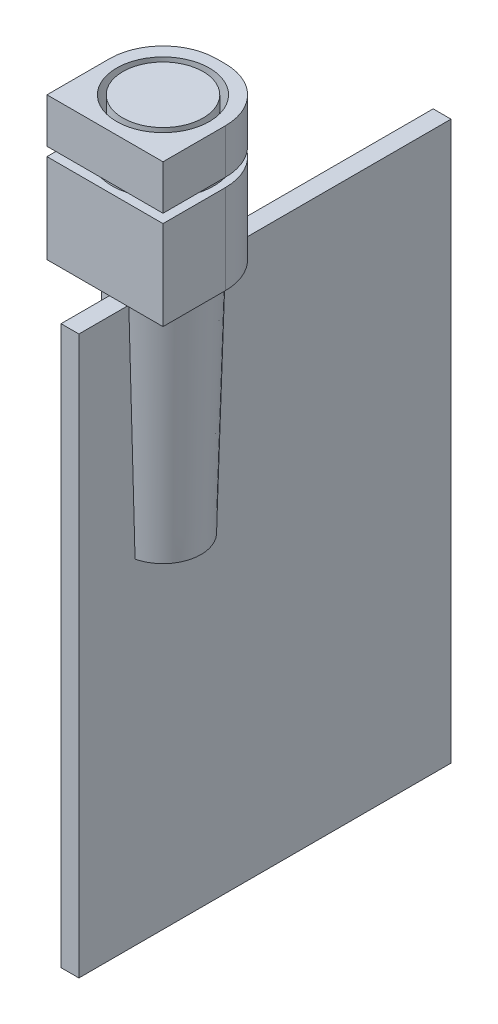
ISO-10303-21;
HEADER;
FILE_DESCRIPTION(('STEP AP214'),'2;1');
FILE_NAME('part.step','',(''),(''),'','','');
FILE_SCHEMA(('AUTOMOTIVE_DESIGN { 1 0 10303 214 1 1 1 1 }'));
ENDSEC;
DATA;
#1=APPLICATION_CONTEXT('core data for automotive mechanical design processes');
#2=APPLICATION_PROTOCOL_DEFINITION('international standard','automotive_design',2000,#1);
#3=PRODUCT_CONTEXT('',#1,'mechanical');
#4=PRODUCT('Part','Part','',(#3));
#5=PRODUCT_RELATED_PRODUCT_CATEGORY('part','',(#4));
#6=PRODUCT_DEFINITION_FORMATION('','',#4);
#7=PRODUCT_DEFINITION_CONTEXT('part definition',#1,'design');
#8=PRODUCT_DEFINITION('design','',#6,#7);
#9=PRODUCT_DEFINITION_SHAPE('','',#8);
#10=(LENGTH_UNIT() NAMED_UNIT(*) SI_UNIT(.MILLI.,.METRE.));
#11=(NAMED_UNIT(*) PLANE_ANGLE_UNIT() SI_UNIT($,.RADIAN.));
#12=(NAMED_UNIT(*) SI_UNIT($,.STERADIAN.) SOLID_ANGLE_UNIT());
#13=UNCERTAINTY_MEASURE_WITH_UNIT(LENGTH_MEASURE(1.E-05),#10,'distance_accuracy_value','');
#14=(GEOMETRIC_REPRESENTATION_CONTEXT(3) GLOBAL_UNCERTAINTY_ASSIGNED_CONTEXT((#13)) GLOBAL_UNIT_ASSIGNED_CONTEXT((#10,
#11,#12)) REPRESENTATION_CONTEXT('',''));
#15=CARTESIAN_POINT('',(0.,0.,0.));
#16=DIRECTION('',(0.,0.,1.));
#17=DIRECTION('',(1.,0.,0.));
#18=AXIS2_PLACEMENT_3D('',#15,#16,#17);
#19=CARTESIAN_POINT('',(-650.,-1600.,650.));
#20=DIRECTION('',(-1.,0.,0.));
#21=DIRECTION('',(0.,0.,1.));
#22=AXIS2_PLACEMENT_3D('',#19,#20,#21);
#23=PLANE('',#22);
#24=DIRECTION('',(0.,0.,1.));
#25=VECTOR('',#24,1.);
#26=CARTESIAN_POINT('',(-650.,-600.,650.));
#27=LINE('',#26,#25);
#28=CARTESIAN_POINT('',(-650.,-600.,-49.9999999999998));
#29=VERTEX_POINT('',#28);
#30=CARTESIAN_POINT('',(-650.,-600.,650.));
#31=VERTEX_POINT('',#30);
#32=EDGE_CURVE('E133',#29,#31,#27,.T.);
#33=ORIENTED_EDGE('',*,*,#32,.F.);
#34=DIRECTION('',(0.,1.,0.));
#35=VECTOR('',#34,1.);
#36=CARTESIAN_POINT('',(-650.,-1600.,-49.9999999999998));
#37=LINE('',#36,#35);
#38=CARTESIAN_POINT('',(-650.,-1600.,-49.9999999999998));
#39=VERTEX_POINT('',#38);
#40=EDGE_CURVE('E77',#29,#39,#37,.F.);
#41=ORIENTED_EDGE('',*,*,#40,.T.);
#42=DIRECTION('',(0.,0.,1.));
#43=VECTOR('',#42,1.);
#44=CARTESIAN_POINT('',(-650.,-1600.,650.));
#45=LINE('',#44,#43);
#46=CARTESIAN_POINT('',(-650.,-1600.,650.));
#47=VERTEX_POINT('',#46);
#48=EDGE_CURVE('E108',#39,#47,#45,.T.);
#49=ORIENTED_EDGE('',*,*,#48,.T.);
#50=DIRECTION('',(0.,1.,0.));
#51=VECTOR('',#50,1.);
#52=CARTESIAN_POINT('',(-650.,-1600.,650.));
#53=LINE('',#52,#51);
#54=EDGE_CURVE('E110',#47,#31,#53,.T.);
#55=ORIENTED_EDGE('',*,*,#54,.T.);
#56=EDGE_LOOP('',(#33,#41,#49,#55));
#57=FACE_BOUND('',#56,.T.);
#58=ADVANCED_FACE('F54',(#57),#23,.T.);
#59=CARTESIAN_POINT('',(650.,-1600.,-650.));
#60=DIRECTION('',(0.,0.,-1.));
#61=DIRECTION('',(-1.,0.,0.));
#62=AXIS2_PLACEMENT_3D('',#59,#60,#61);
#63=PLANE('',#62);
#64=DIRECTION('',(-1.,0.,0.));
#65=VECTOR('',#64,1.);
#66=CARTESIAN_POINT('',(650.,-1600.,-650.));
#67=LINE('',#66,#65);
#68=CARTESIAN_POINT('',(50.0000000000002,-1600.,-650.));
#69=VERTEX_POINT('',#68);
#70=CARTESIAN_POINT('',(-49.9999999999999,-1600.,-650.));
#71=VERTEX_POINT('',#70);
#72=EDGE_CURVE('E123',#69,#71,#67,.T.);
#73=ORIENTED_EDGE('',*,*,#72,.T.);
#74=DIRECTION('',(0.,1.,0.));
#75=VECTOR('',#74,1.);
#76=CARTESIAN_POINT('',(-49.9999999999999,-1600.,-650.));
#77=LINE('',#76,#75);
#78=CARTESIAN_POINT('',(-49.9999999999999,-600.,-650.));
#79=VERTEX_POINT('',#78);
#80=EDGE_CURVE('E145',#71,#79,#77,.T.);
#81=ORIENTED_EDGE('',*,*,#80,.T.);
#82=DIRECTION('',(-1.,0.,0.));
#83=VECTOR('',#82,1.);
#84=CARTESIAN_POINT('',(650.,-600.,-650.));
#85=LINE('',#84,#83);
#86=CARTESIAN_POINT('',(50.0000000000002,-600.,-650.));
#87=VERTEX_POINT('',#86);
#88=EDGE_CURVE('E115',#87,#79,#85,.T.);
#89=ORIENTED_EDGE('',*,*,#88,.F.);
#90=DIRECTION('',(0.,1.,0.));
#91=VECTOR('',#90,1.);
#92=CARTESIAN_POINT('',(50.0000000000002,-1600.,-650.));
#93=LINE('',#92,#91);
#94=EDGE_CURVE('E142',#87,#69,#93,.F.);
#95=ORIENTED_EDGE('',*,*,#94,.T.);
#96=EDGE_LOOP('',(#73,#81,#89,#95));
#97=FACE_BOUND('',#96,.T.);
#98=ADVANCED_FACE('F156',(#97),#63,.T.);
#99=CARTESIAN_POINT('',(650.,-1600.,650.));
#100=DIRECTION('',(1.,0.,0.));
#101=DIRECTION('',(0.,0.,-1.));
#102=AXIS2_PLACEMENT_3D('',#99,#100,#101);
#103=PLANE('',#102);
#104=DIRECTION('',(0.,0.,-1.));
#105=VECTOR('',#104,1.);
#106=CARTESIAN_POINT('',(650.,-1600.,650.));
#107=LINE('',#106,#105);
#108=CARTESIAN_POINT('',(650.,-1600.,650.));
#109=VERTEX_POINT('',#108);
#110=CARTESIAN_POINT('',(650.,-1600.,-49.9999999999999));
#111=VERTEX_POINT('',#110);
#112=EDGE_CURVE('E126',#109,#111,#107,.T.);
#113=ORIENTED_EDGE('',*,*,#112,.T.);
#114=DIRECTION('',(0.,1.,0.));
#115=VECTOR('',#114,1.);
#116=CARTESIAN_POINT('',(650.,-1600.,-49.9999999999999));
#117=LINE('',#116,#115);
#118=CARTESIAN_POINT('',(650.,-600.,-49.9999999999999));
#119=VERTEX_POINT('',#118);
#120=EDGE_CURVE('E13',#111,#119,#117,.T.);
#121=ORIENTED_EDGE('',*,*,#120,.T.);
#122=DIRECTION('',(0.,0.,-1.));
#123=VECTOR('',#122,1.);
#124=CARTESIAN_POINT('',(650.,-600.,650.));
#125=LINE('',#124,#123);
#126=CARTESIAN_POINT('',(650.,-600.,650.));
#127=VERTEX_POINT('',#126);
#128=EDGE_CURVE('E137',#127,#119,#125,.T.);
#129=ORIENTED_EDGE('',*,*,#128,.F.);
#130=DIRECTION('',(0.,1.,0.));
#131=VECTOR('',#130,1.);
#132=CARTESIAN_POINT('',(650.,-1600.,650.));
#133=LINE('',#132,#131);
#134=EDGE_CURVE('E122',#109,#127,#133,.T.);
#135=ORIENTED_EDGE('',*,*,#134,.F.);
#136=EDGE_LOOP('',(#113,#121,#129,#135));
#137=FACE_BOUND('',#136,.T.);
#138=ADVANCED_FACE('F166',(#137),#103,.T.);
#139=CARTESIAN_POINT('',(650.,-1600.,650.));
#140=DIRECTION('',(0.,0.,1.));
#141=DIRECTION('',(1.,0.,0.));
#142=AXIS2_PLACEMENT_3D('',#139,#140,#141);
#143=PLANE('',#142);
#144=DIRECTION('',(1.,0.,0.));
#145=VECTOR('',#144,1.);
#146=CARTESIAN_POINT('',(650.,-600.,650.));
#147=LINE('',#146,#145);
#148=EDGE_CURVE('E121',#31,#127,#147,.T.);
#149=ORIENTED_EDGE('',*,*,#148,.F.);
#150=ORIENTED_EDGE('',*,*,#54,.F.);
#151=DIRECTION('',(1.,0.,0.));
#152=VECTOR('',#151,1.);
#153=CARTESIAN_POINT('',(650.,-1600.,650.));
#154=LINE('',#153,#152);
#155=EDGE_CURVE('E114',#47,#109,#154,.T.);
#156=ORIENTED_EDGE('',*,*,#155,.T.);
#157=ORIENTED_EDGE('',*,*,#134,.T.);
#158=EDGE_LOOP('',(#149,#150,#156,#157));
#159=FACE_BOUND('',#158,.T.);
#160=ADVANCED_FACE('F119',(#159),#143,.T.);
#161=CARTESIAN_POINT('',(0.,-1600.,0.));
#162=DIRECTION('',(0.,1.,0.));
#163=DIRECTION('',(0.,0.,1.));
#164=AXIS2_PLACEMENT_3D('',#161,#162,#163);
#165=PLANE('',#164);
#166=CARTESIAN_POINT('',(0.,-1600.,0.));
#167=DIRECTION('',(0.,1.,0.));
#168=DIRECTION('',(0.,0.,1.));
#169=AXIS2_PLACEMENT_3D('',#166,#167,#168);
#170=CIRCLE('',#169,570.);
#171=CARTESIAN_POINT('',(0.,-1600.,570.));
#172=VERTEX_POINT('',#171);
#173=EDGE_CURVE('E135',#172,#172,#170,.T.);
#174=ORIENTED_EDGE('',*,*,#173,.T.);
#175=EDGE_LOOP('',(#174));
#176=FACE_BOUND('',#175,.T.);
#177=ORIENTED_EDGE('',*,*,#48,.F.);
#178=CARTESIAN_POINT('',(-49.9999999999999,-1600.,-49.9999999999999));
#179=DIRECTION('',(0.,1.,0.));
#180=DIRECTION('',(0.,0.,1.));
#181=AXIS2_PLACEMENT_3D('',#178,#179,#180);
#182=CIRCLE('',#181,600.);
#183=EDGE_CURVE('E62',#39,#71,#182,.F.);
#184=ORIENTED_EDGE('',*,*,#183,.T.);
#185=ORIENTED_EDGE('',*,*,#72,.F.);
#186=CARTESIAN_POINT('',(50.0000000000002,-1600.,-49.9999999999999));
#187=DIRECTION('',(0.,1.,0.));
#188=DIRECTION('',(0.,0.,1.));
#189=AXIS2_PLACEMENT_3D('',#186,#187,#188);
#190=CIRCLE('',#189,600.);
#191=EDGE_CURVE('E69',#69,#111,#190,.F.);
#192=ORIENTED_EDGE('',*,*,#191,.T.);
#193=ORIENTED_EDGE('',*,*,#112,.F.);
#194=ORIENTED_EDGE('',*,*,#155,.F.);
#195=EDGE_LOOP('',(#177,#184,#185,#192,#193,#194));
#196=FACE_BOUND('',#195,.T.);
#197=ADVANCED_FACE('F125',(#176,#196),#165,.F.);
#198=CARTESIAN_POINT('',(0.,-600.,0.));
#199=DIRECTION('',(0.,1.,0.));
#200=DIRECTION('',(0.,0.,1.));
#201=AXIS2_PLACEMENT_3D('',#198,#199,#200);
#202=PLANE('',#201);
#203=CARTESIAN_POINT('',(0.,-600.,0.));
#204=DIRECTION('',(0.,1.,0.));
#205=DIRECTION('',(0.,0.,1.));
#206=AXIS2_PLACEMENT_3D('',#203,#204,#205);
#207=CIRCLE('',#206,570.);
#208=CARTESIAN_POINT('',(0.,-600.,570.));
#209=VERTEX_POINT('',#208);
#210=EDGE_CURVE('E200',#209,#209,#207,.T.);
#211=ORIENTED_EDGE('',*,*,#210,.F.);
#212=EDGE_LOOP('',(#211));
#213=FACE_BOUND('',#212,.T.);
#214=ORIENTED_EDGE('',*,*,#88,.T.);
#215=CARTESIAN_POINT('',(-49.9999999999999,-600.,-49.9999999999999));
#216=DIRECTION('',(0.,1.,0.));
#217=DIRECTION('',(0.,0.,1.));
#218=AXIS2_PLACEMENT_3D('',#215,#216,#217);
#219=CIRCLE('',#218,600.);
#220=EDGE_CURVE('E150',#79,#29,#219,.T.);
#221=ORIENTED_EDGE('',*,*,#220,.T.);
#222=ORIENTED_EDGE('',*,*,#32,.T.);
#223=ORIENTED_EDGE('',*,*,#148,.T.);
#224=ORIENTED_EDGE('',*,*,#128,.T.);
#225=CARTESIAN_POINT('',(50.0000000000002,-600.,-49.9999999999999));
#226=DIRECTION('',(0.,1.,0.));
#227=DIRECTION('',(0.,0.,1.));
#228=AXIS2_PLACEMENT_3D('',#225,#226,#227);
#229=CIRCLE('',#228,600.);
#230=EDGE_CURVE('E148',#119,#87,#229,.T.);
#231=ORIENTED_EDGE('',*,*,#230,.T.);
#232=EDGE_LOOP('',(#214,#221,#222,#223,#224,#231));
#233=FACE_BOUND('',#232,.T.);
#234=ADVANCED_FACE('F161',(#213,#233),#202,.T.);
#235=CARTESIAN_POINT('',(0.,-1600.,0.));
#236=DIRECTION('',(0.,1.,0.));
#237=DIRECTION('',(0.,0.,1.));
#238=AXIS2_PLACEMENT_3D('',#235,#236,#237);
#239=CYLINDRICAL_SURFACE('',#238,570.);
#240=ORIENTED_EDGE('',*,*,#173,.F.);
#241=EDGE_LOOP('',(#240));
#242=FACE_BOUND('',#241,.T.);
#243=ORIENTED_EDGE('',*,*,#210,.T.);
#244=EDGE_LOOP('',(#243));
#245=FACE_BOUND('',#244,.T.);
#246=ADVANCED_FACE('F180',(#242,#245),#239,.F.);
#247=CARTESIAN_POINT('',(-49.9999999999999,-1600.,-49.9999999999999));
#248=DIRECTION('',(0.,1.,0.));
#249=DIRECTION('',(0.,0.,1.));
#250=AXIS2_PLACEMENT_3D('',#247,#248,#249);
#251=CYLINDRICAL_SURFACE('',#250,600.);
#252=ORIENTED_EDGE('',*,*,#183,.F.);
#253=ORIENTED_EDGE('',*,*,#40,.F.);
#254=ORIENTED_EDGE('',*,*,#220,.F.);
#255=ORIENTED_EDGE('',*,*,#80,.F.);
#256=EDGE_LOOP('',(#252,#253,#254,#255));
#257=FACE_BOUND('',#256,.T.);
#258=ADVANCED_FACE('F159',(#257),#251,.T.);
#259=CARTESIAN_POINT('',(50.0000000000002,-1600.,-49.9999999999999));
#260=DIRECTION('',(0.,1.,0.));
#261=DIRECTION('',(0.,0.,1.));
#262=AXIS2_PLACEMENT_3D('',#259,#260,#261);
#263=CYLINDRICAL_SURFACE('',#262,600.);
#264=ORIENTED_EDGE('',*,*,#191,.F.);
#265=ORIENTED_EDGE('',*,*,#94,.F.);
#266=ORIENTED_EDGE('',*,*,#230,.F.);
#267=ORIENTED_EDGE('',*,*,#120,.F.);
#268=EDGE_LOOP('',(#264,#265,#266,#267));
#269=FACE_BOUND('',#268,.T.);
#270=ADVANCED_FACE('F56',(#269),#263,.T.);
#271=CLOSED_SHELL('',(#58,#98,#138,#160,#197,#234,#246,#258,#270));
#272=MANIFOLD_SOLID_BREP('B2',#271);
#273=CARTESIAN_POINT('',(650.,-500.,-650.));
#274=DIRECTION('',(1.,0.,0.));
#275=DIRECTION('',(0.,0.,-1.));
#276=AXIS2_PLACEMENT_3D('',#273,#274,#275);
#277=PLANE('',#276);
#278=DIRECTION('',(0.,0.,-1.));
#279=VECTOR('',#278,1.);
#280=CARTESIAN_POINT('',(650.,-500.,-650.));
#281=LINE('',#280,#279);
#282=CARTESIAN_POINT('',(650.,-500.,650.));
#283=VERTEX_POINT('',#282);
#284=CARTESIAN_POINT('',(650.,-500.,-50.0000000000002));
#285=VERTEX_POINT('',#284);
#286=EDGE_CURVE('E334',#283,#285,#281,.T.);
#287=ORIENTED_EDGE('',*,*,#286,.T.);
#288=DIRECTION('',(0.,1.,0.));
#289=VECTOR('',#288,1.);
#290=CARTESIAN_POINT('',(650.,-500.,-50.0000000000002));
#291=LINE('',#290,#289);
#292=CARTESIAN_POINT('',(650.,0.,-50.0000000000002));
#293=VERTEX_POINT('',#292);
#294=EDGE_CURVE('E52',#285,#293,#291,.T.);
#295=ORIENTED_EDGE('',*,*,#294,.T.);
#296=DIRECTION('',(0.,0.,-1.));
#297=VECTOR('',#296,1.);
#298=CARTESIAN_POINT('',(650.,0.,-650.));
#299=LINE('',#298,#297);
#300=CARTESIAN_POINT('',(650.,0.,650.));
#301=VERTEX_POINT('',#300);
#302=EDGE_CURVE('E338',#301,#293,#299,.T.);
#303=ORIENTED_EDGE('',*,*,#302,.F.);
#304=DIRECTION('',(0.,1.,0.));
#305=VECTOR('',#304,1.);
#306=CARTESIAN_POINT('',(650.,-500.,650.));
#307=LINE('',#306,#305);
#308=EDGE_CURVE('E331',#283,#301,#307,.T.);
#309=ORIENTED_EDGE('',*,*,#308,.F.);
#310=EDGE_LOOP('',(#287,#295,#303,#309));
#311=FACE_BOUND('',#310,.T.);
#312=ADVANCED_FACE('F262',(#311),#277,.T.);
#313=CARTESIAN_POINT('',(-650.,-500.,650.));
#314=DIRECTION('',(0.,0.,1.));
#315=DIRECTION('',(1.,0.,0.));
#316=AXIS2_PLACEMENT_3D('',#313,#314,#315);
#317=PLANE('',#316);
#318=DIRECTION('',(1.,0.,0.));
#319=VECTOR('',#318,1.);
#320=CARTESIAN_POINT('',(-650.,0.,650.));
#321=LINE('',#320,#319);
#322=CARTESIAN_POINT('',(-650.,0.,650.));
#323=VERTEX_POINT('',#322);
#324=EDGE_CURVE('E330',#323,#301,#321,.T.);
#325=ORIENTED_EDGE('',*,*,#324,.F.);
#326=DIRECTION('',(0.,1.,0.));
#327=VECTOR('',#326,1.);
#328=CARTESIAN_POINT('',(-650.,-500.,650.));
#329=LINE('',#328,#327);
#330=CARTESIAN_POINT('',(-650.,-500.,650.));
#331=VERTEX_POINT('',#330);
#332=EDGE_CURVE('E319',#331,#323,#329,.T.);
#333=ORIENTED_EDGE('',*,*,#332,.F.);
#334=DIRECTION('',(1.,0.,0.));
#335=VECTOR('',#334,1.);
#336=CARTESIAN_POINT('',(-650.,-500.,650.));
#337=LINE('',#336,#335);
#338=EDGE_CURVE('E323',#331,#283,#337,.T.);
#339=ORIENTED_EDGE('',*,*,#338,.T.);
#340=ORIENTED_EDGE('',*,*,#308,.T.);
#341=EDGE_LOOP('',(#325,#333,#339,#340));
#342=FACE_BOUND('',#341,.T.);
#343=ADVANCED_FACE('F328',(#342),#317,.T.);
#344=CARTESIAN_POINT('',(-650.,-500.,-650.));
#345=DIRECTION('',(-1.,0.,0.));
#346=DIRECTION('',(0.,0.,1.));
#347=AXIS2_PLACEMENT_3D('',#344,#345,#346);
#348=PLANE('',#347);
#349=DIRECTION('',(0.,0.,1.));
#350=VECTOR('',#349,1.);
#351=CARTESIAN_POINT('',(-650.,0.,-650.));
#352=LINE('',#351,#350);
#353=CARTESIAN_POINT('',(-650.,0.,-49.9999999999999));
#354=VERTEX_POINT('',#353);
#355=EDGE_CURVE('E345',#354,#323,#352,.T.);
#356=ORIENTED_EDGE('',*,*,#355,.F.);
#357=DIRECTION('',(0.,1.,0.));
#358=VECTOR('',#357,1.);
#359=CARTESIAN_POINT('',(-650.,-500.,-49.9999999999999));
#360=LINE('',#359,#358);
#361=CARTESIAN_POINT('',(-650.,-500.,-49.9999999999999));
#362=VERTEX_POINT('',#361);
#363=EDGE_CURVE('E285',#354,#362,#360,.F.);
#364=ORIENTED_EDGE('',*,*,#363,.T.);
#365=DIRECTION('',(0.,0.,1.));
#366=VECTOR('',#365,1.);
#367=CARTESIAN_POINT('',(-650.,-500.,-650.));
#368=LINE('',#367,#366);
#369=EDGE_CURVE('E316',#362,#331,#368,.T.);
#370=ORIENTED_EDGE('',*,*,#369,.T.);
#371=ORIENTED_EDGE('',*,*,#332,.T.);
#372=EDGE_LOOP('',(#356,#364,#370,#371));
#373=FACE_BOUND('',#372,.T.);
#374=ADVANCED_FACE('F318',(#373),#348,.T.);
#375=CARTESIAN_POINT('',(-650.,-500.,-650.));
#376=DIRECTION('',(0.,0.,-1.));
#377=DIRECTION('',(-1.,0.,0.));
#378=AXIS2_PLACEMENT_3D('',#375,#376,#377);
#379=PLANE('',#378);
#380=DIRECTION('',(-1.,0.,0.));
#381=VECTOR('',#380,1.);
#382=CARTESIAN_POINT('',(-650.,-500.,-650.));
#383=LINE('',#382,#381);
#384=CARTESIAN_POINT('',(50.,-500.,-650.));
#385=VERTEX_POINT('',#384);
#386=CARTESIAN_POINT('',(-50.,-500.,-650.));
#387=VERTEX_POINT('',#386);
#388=EDGE_CURVE('E324',#385,#387,#383,.T.);
#389=ORIENTED_EDGE('',*,*,#388,.T.);
#390=DIRECTION('',(0.,1.,0.));
#391=VECTOR('',#390,1.);
#392=CARTESIAN_POINT('',(-50.,-500.,-650.));
#393=LINE('',#392,#391);
#394=CARTESIAN_POINT('',(-50.,0.,-650.));
#395=VERTEX_POINT('',#394);
#396=EDGE_CURVE('E351',#387,#395,#393,.T.);
#397=ORIENTED_EDGE('',*,*,#396,.T.);
#398=DIRECTION('',(-1.,0.,0.));
#399=VECTOR('',#398,1.);
#400=CARTESIAN_POINT('',(-650.,0.,-650.));
#401=LINE('',#400,#399);
#402=CARTESIAN_POINT('',(50.,0.,-650.));
#403=VERTEX_POINT('',#402);
#404=EDGE_CURVE('E341',#403,#395,#401,.T.);
#405=ORIENTED_EDGE('',*,*,#404,.F.);
#406=DIRECTION('',(0.,1.,0.));
#407=VECTOR('',#406,1.);
#408=CARTESIAN_POINT('',(50.,-500.,-650.));
#409=LINE('',#408,#407);
#410=EDGE_CURVE('E348',#403,#385,#409,.F.);
#411=ORIENTED_EDGE('',*,*,#410,.T.);
#412=EDGE_LOOP('',(#389,#397,#405,#411));
#413=FACE_BOUND('',#412,.T.);
#414=ADVANCED_FACE('F363',(#413),#379,.T.);
#415=CARTESIAN_POINT('',(0.,-500.,0.));
#416=DIRECTION('',(0.,1.,0.));
#417=DIRECTION('',(0.,0.,1.));
#418=AXIS2_PLACEMENT_3D('',#415,#416,#417);
#419=PLANE('',#418);
#420=CARTESIAN_POINT('',(0.,-500.,0.));
#421=DIRECTION('',(0.,1.,0.));
#422=DIRECTION('',(0.,0.,1.));
#423=AXIS2_PLACEMENT_3D('',#420,#421,#422);
#424=CIRCLE('',#423,520.);
#425=CARTESIAN_POINT('',(0.,-500.,520.));
#426=VERTEX_POINT('',#425);
#427=EDGE_CURVE('E342',#426,#426,#424,.T.);
#428=ORIENTED_EDGE('',*,*,#427,.T.);
#429=EDGE_LOOP('',(#428));
#430=FACE_BOUND('',#429,.T.);
#431=ORIENTED_EDGE('',*,*,#369,.F.);
#432=CARTESIAN_POINT('',(-50.,-500.,-50.));
#433=DIRECTION('',(0.,1.,0.));
#434=DIRECTION('',(0.,0.,1.));
#435=AXIS2_PLACEMENT_3D('',#432,#433,#434);
#436=CIRCLE('',#435,600.);
#437=EDGE_CURVE('E270',#362,#387,#436,.F.);
#438=ORIENTED_EDGE('',*,*,#437,.T.);
#439=ORIENTED_EDGE('',*,*,#388,.F.);
#440=CARTESIAN_POINT('',(50.,-500.,-50.));
#441=DIRECTION('',(0.,1.,0.));
#442=DIRECTION('',(0.,0.,1.));
#443=AXIS2_PLACEMENT_3D('',#440,#441,#442);
#444=CIRCLE('',#443,600.);
#445=EDGE_CURVE('E277',#385,#285,#444,.F.);
#446=ORIENTED_EDGE('',*,*,#445,.T.);
#447=ORIENTED_EDGE('',*,*,#286,.F.);
#448=ORIENTED_EDGE('',*,*,#338,.F.);
#449=EDGE_LOOP('',(#431,#438,#439,#446,#447,#448));
#450=FACE_BOUND('',#449,.T.);
#451=ADVANCED_FACE('F333',(#430,#450),#419,.F.);
#452=CARTESIAN_POINT('',(0.,0.,0.));
#453=DIRECTION('',(0.,1.,0.));
#454=DIRECTION('',(0.,0.,1.));
#455=AXIS2_PLACEMENT_3D('',#452,#453,#454);
#456=PLANE('',#455);
#457=CARTESIAN_POINT('',(0.,0.,0.));
#458=DIRECTION('',(0.,1.,0.));
#459=DIRECTION('',(0.,0.,1.));
#460=AXIS2_PLACEMENT_3D('',#457,#458,#459);
#461=CIRCLE('',#460,520.);
#462=CARTESIAN_POINT('',(0.,0.,520.));
#463=VERTEX_POINT('',#462);
#464=EDGE_CURVE('E375',#463,#463,#461,.T.);
#465=ORIENTED_EDGE('',*,*,#464,.F.);
#466=EDGE_LOOP('',(#465));
#467=FACE_BOUND('',#466,.T.);
#468=ORIENTED_EDGE('',*,*,#404,.T.);
#469=CARTESIAN_POINT('',(-50.,0.,-50.));
#470=DIRECTION('',(0.,1.,0.));
#471=DIRECTION('',(0.,0.,1.));
#472=AXIS2_PLACEMENT_3D('',#469,#470,#471);
#473=CIRCLE('',#472,600.);
#474=EDGE_CURVE('E356',#395,#354,#473,.T.);
#475=ORIENTED_EDGE('',*,*,#474,.T.);
#476=ORIENTED_EDGE('',*,*,#355,.T.);
#477=ORIENTED_EDGE('',*,*,#324,.T.);
#478=ORIENTED_EDGE('',*,*,#302,.T.);
#479=CARTESIAN_POINT('',(50.,0.,-50.));
#480=DIRECTION('',(0.,1.,0.));
#481=DIRECTION('',(0.,0.,1.));
#482=AXIS2_PLACEMENT_3D('',#479,#480,#481);
#483=CIRCLE('',#482,600.);
#484=EDGE_CURVE('E354',#293,#403,#483,.T.);
#485=ORIENTED_EDGE('',*,*,#484,.T.);
#486=EDGE_LOOP('',(#468,#475,#476,#477,#478,#485));
#487=FACE_BOUND('',#486,.T.);
#488=ADVANCED_FACE('F368',(#467,#487),#456,.T.);
#489=CARTESIAN_POINT('',(0.,-500.,0.));
#490=DIRECTION('',(0.,1.,0.));
#491=DIRECTION('',(0.,0.,1.));
#492=AXIS2_PLACEMENT_3D('',#489,#490,#491);
#493=CYLINDRICAL_SURFACE('',#492,520.);
#494=ORIENTED_EDGE('',*,*,#427,.F.);
#495=EDGE_LOOP('',(#494));
#496=FACE_BOUND('',#495,.T.);
#497=ORIENTED_EDGE('',*,*,#464,.T.);
#498=EDGE_LOOP('',(#497));
#499=FACE_BOUND('',#498,.T.);
#500=ADVANCED_FACE('F382',(#496,#499),#493,.F.);
#501=CARTESIAN_POINT('',(-50.,-500.,-50.));
#502=DIRECTION('',(0.,1.,0.));
#503=DIRECTION('',(0.,0.,1.));
#504=AXIS2_PLACEMENT_3D('',#501,#502,#503);
#505=CYLINDRICAL_SURFACE('',#504,600.);
#506=ORIENTED_EDGE('',*,*,#437,.F.);
#507=ORIENTED_EDGE('',*,*,#363,.F.);
#508=ORIENTED_EDGE('',*,*,#474,.F.);
#509=ORIENTED_EDGE('',*,*,#396,.F.);
#510=EDGE_LOOP('',(#506,#507,#508,#509));
#511=FACE_BOUND('',#510,.T.);
#512=ADVANCED_FACE('F366',(#511),#505,.T.);
#513=CARTESIAN_POINT('',(50.,-500.,-50.));
#514=DIRECTION('',(0.,1.,0.));
#515=DIRECTION('',(0.,0.,1.));
#516=AXIS2_PLACEMENT_3D('',#513,#514,#515);
#517=CYLINDRICAL_SURFACE('',#516,600.);
#518=ORIENTED_EDGE('',*,*,#445,.F.);
#519=ORIENTED_EDGE('',*,*,#410,.F.);
#520=ORIENTED_EDGE('',*,*,#484,.F.);
#521=ORIENTED_EDGE('',*,*,#294,.F.);
#522=EDGE_LOOP('',(#518,#519,#520,#521));
#523=FACE_BOUND('',#522,.T.);
#524=ADVANCED_FACE('F264',(#523),#517,.T.);
#525=CLOSED_SHELL('',(#312,#343,#374,#414,#451,#488,#500,#512,#524));
#526=MANIFOLD_SOLID_BREP('B7',#525);
#527=CARTESIAN_POINT('',(0.,-4250.,0.));
#528=DIRECTION('',(0.,-1.,0.));
#529=DIRECTION('',(0.,0.,-1.));
#530=AXIS2_PLACEMENT_3D('',#527,#528,#529);
#531=PLANE('',#530);
#532=CARTESIAN_POINT('',(0.,-4250.,0.));
#533=DIRECTION('',(0.,-1.,0.));
#534=DIRECTION('',(0.,0.,-1.));
#535=AXIS2_PLACEMENT_3D('',#532,#533,#534);
#536=CIRCLE('',#535,425.);
#537=CARTESIAN_POINT('',(-100.,-4250.,413.067791046458));
#538=VERTEX_POINT('',#537);
#539=CARTESIAN_POINT('',(-100.,-4250.,-413.067792265562));
#540=VERTEX_POINT('',#539);
#541=EDGE_CURVE('E560',#538,#540,#536,.T.);
#542=ORIENTED_EDGE('',*,*,#541,.T.);
#543=DIRECTION('',(0.,0.,1.));
#544=VECTOR('',#543,1.);
#545=CARTESIAN_POINT('',(-100.,-4250.,0.));
#546=LINE('',#545,#544);
#547=EDGE_CURVE('E548',#540,#538,#546,.T.);
#548=ORIENTED_EDGE('',*,*,#547,.T.);
#549=EDGE_LOOP('',(#542,#548));
#550=FACE_BOUND('',#549,.T.);
#551=ADVANCED_FACE('F458',(#550),#531,.T.);
#552=CARTESIAN_POINT('',(0.,-500.,0.));
#553=DIRECTION('',(0.,1.,0.));
#554=DIRECTION('',(0.,0.,1.));
#555=AXIS2_PLACEMENT_3D('',#552,#553,#554);
#556=CYLINDRICAL_SURFACE('',#555,450.);
#557=CARTESIAN_POINT('',(0.,-500.,0.));
#558=DIRECTION('',(0.,-1.,0.));
#559=DIRECTION('',(0.,0.,-1.));
#560=AXIS2_PLACEMENT_3D('',#557,#558,#559);
#561=CIRCLE('',#560,450.);
#562=CARTESIAN_POINT('',(0.,-500.,-450.));
#563=VERTEX_POINT('',#562);
#564=EDGE_CURVE('E703',#563,#563,#561,.T.);
#565=ORIENTED_EDGE('',*,*,#564,.F.);
#566=EDGE_LOOP('',(#565));
#567=FACE_BOUND('',#566,.T.);
#568=CARTESIAN_POINT('',(0.,0.,0.));
#569=DIRECTION('',(0.,1.,0.));
#570=DIRECTION('',(0.,0.,1.));
#571=AXIS2_PLACEMENT_3D('',#568,#569,#570);
#572=CIRCLE('',#571,450.);
#573=CARTESIAN_POINT('',(0.,0.,450.));
#574=VERTEX_POINT('',#573);
#575=EDGE_CURVE('E659',#574,#574,#572,.T.);
#576=ORIENTED_EDGE('',*,*,#575,.F.);
#577=EDGE_LOOP('',(#576));
#578=FACE_BOUND('',#577,.T.);
#579=ADVANCED_FACE('F460',(#567,#578),#556,.T.);
#580=CARTESIAN_POINT('',(0.,0.,0.));
#581=DIRECTION('',(0.,1.,0.));
#582=DIRECTION('',(0.,0.,1.));
#583=AXIS2_PLACEMENT_3D('',#580,#581,#582);
#584=PLANE('',#583);
#585=ORIENTED_EDGE('',*,*,#575,.T.);
#586=EDGE_LOOP('',(#585));
#587=FACE_BOUND('',#586,.T.);
#588=ADVANCED_FACE('F641',(#587),#584,.T.);
#589=CARTESIAN_POINT('',(0.,-600.,0.));
#590=DIRECTION('',(0.,-1.,0.));
#591=DIRECTION('',(0.,0.,-1.));
#592=AXIS2_PLACEMENT_3D('',#589,#590,#591);
#593=CONICAL_SURFACE('',#592,500.,0.463647609000804);
#594=ORIENTED_EDGE('',*,*,#564,.T.);
#595=EDGE_LOOP('',(#594));
#596=FACE_BOUND('',#595,.T.);
#597=CARTESIAN_POINT('',(0.,-600.,0.));
#598=DIRECTION('',(0.,-1.,0.));
#599=DIRECTION('',(0.,0.,-1.));
#600=AXIS2_PLACEMENT_3D('',#597,#598,#599);
#601=CIRCLE('',#600,500.);
#602=CARTESIAN_POINT('',(0.,-600.,-500.));
#603=VERTEX_POINT('',#602);
#604=EDGE_CURVE('E694',#603,#603,#601,.T.);
#605=ORIENTED_EDGE('',*,*,#604,.F.);
#606=EDGE_LOOP('',(#605));
#607=FACE_BOUND('',#606,.T.);
#608=ADVANCED_FACE('F650',(#596,#607),#593,.T.);
#609=CARTESIAN_POINT('',(0.,-1500.,0.));
#610=DIRECTION('',(0.,-1.,0.));
#611=DIRECTION('',(0.,0.,-1.));
#612=AXIS2_PLACEMENT_3D('',#609,#610,#611);
#613=CYLINDRICAL_SURFACE('',#612,500.);
#614=ORIENTED_EDGE('',*,*,#604,.T.);
#615=EDGE_LOOP('',(#614));
#616=FACE_BOUND('',#615,.T.);
#617=CARTESIAN_POINT('',(0.,-1500.,0.));
#618=DIRECTION('',(0.,1.,0.));
#619=DIRECTION('',(0.,0.,1.));
#620=AXIS2_PLACEMENT_3D('',#617,#618,#619);
#621=CIRCLE('',#620,500.);
#622=CARTESIAN_POINT('',(0.,-1500.,500.));
#623=VERTEX_POINT('',#622);
#624=EDGE_CURVE('E704',#623,#623,#621,.F.);
#625=ORIENTED_EDGE('',*,*,#624,.F.);
#626=EDGE_LOOP('',(#625));
#627=FACE_BOUND('',#626,.T.);
#628=ADVANCED_FACE('F645',(#616,#627),#613,.T.);
#629=DIRECTION('',(0.,0.,1.));
#630=VECTOR('',#629,1.);
#631=CARTESIAN_POINT('',(100.,-4250.,0.));
#632=LINE('',#631,#630);
#633=CARTESIAN_POINT('',(100.,-4250.,-413.067790915741));
#634=VERTEX_POINT('',#633);
#635=CARTESIAN_POINT('',(100.,-4250.,413.067791046458));
#636=VERTEX_POINT('',#635);
#637=EDGE_CURVE('E551',#634,#636,#632,.T.);
#638=ORIENTED_EDGE('',*,*,#637,.F.);
#639=EDGE_CURVE('E462',#634,#636,#536,.T.);
#640=ORIENTED_EDGE('',*,*,#639,.T.);
#641=EDGE_LOOP('',(#638,#640));
#642=FACE_BOUND('',#641,.T.);
#643=ADVANCED_FACE('F585',(#642),#531,.T.);
#644=CARTESIAN_POINT('',(0.,-4250.,0.));
#645=DIRECTION('',(0.,1.,0.));
#646=DIRECTION('',(0.,0.,1.));
#647=AXIS2_PLACEMENT_3D('',#644,#645,#646);
#648=CONICAL_SURFACE('',#647,425.,0.0272659684555945);
#649=CARTESIAN_POINT('',(100.,942.582696414921,-557.72176643028));
#650=CARTESIAN_POINT('',(100.,758.793754028909,-552.629400712317));
#651=CARTESIAN_POINT('',(100.,575.004871455083,-547.534876315687));
#652=CARTESIAN_POINT('',(100.,207.427235876635,-537.341104891443));
#653=CARTESIAN_POINT('',(100.,23.6384828720143,-532.241857863793));
#654=CARTESIAN_POINT('',(100.,-527.727568232142,-516.936424885863));
#655=CARTESIAN_POINT('',(100.,-895.304652858058,-506.72254719474));
#656=CARTESIAN_POINT('',(100.,-1630.45814066345,-486.27028544391));
#657=CARTESIAN_POINT('',(100.,-1998.03454384292,-476.031901384191));
#658=CARTESIAN_POINT('',(100.,-2549.39852516511,-460.652034200697));
#659=CARTESIAN_POINT('',(100.,-2733.18641422634,-455.521696646399));
#660=CARTESIAN_POINT('',(100.,-3100.76196220156,-445.2527838099));
#661=CARTESIAN_POINT('',(100.,-3284.54962111554,-440.114208527699));
#662=CARTESIAN_POINT('',(100.,-3652.12468312062,-429.827919328194));
#663=CARTESIAN_POINT('',(100.,-3835.91208621172,-424.680205410894));
#664=CARTESIAN_POINT('',(100.,-4203.48660677295,-414.3745911779));
#665=CARTESIAN_POINT('',(100.,-4387.27372424308,-409.216690862207));
#666=CARTESIAN_POINT('',(100.,-4768.68841548795,-398.500627497359));
#667=CARTESIAN_POINT('',(100.,-4966.31596424084,-392.941573739767));
#668=CARTESIAN_POINT('',(100.,-5361.57064041676,-381.808513384708));
#669=CARTESIAN_POINT('',(100.,-5559.19776783979,-376.234506787257));
#670=CARTESIAN_POINT('',(100.,-5954.45154344751,-365.06943016085));
#671=CARTESIAN_POINT('',(100.,-6152.07819163218,-359.478360131665));
#672=CARTESIAN_POINT('',(100.,-6448.51774724977,-351.077044537029));
#673=CARTESIAN_POINT('',(100.,-6547.33086316008,-348.274154242807));
#674=CARTESIAN_POINT('',(100.,-6744.95694502262,-342.663090490847));
#675=CARTESIAN_POINT('',(100.,-6843.76991097486,-339.854917033107));
#676=CARTESIAN_POINT('',(100.,-6942.58279641492,-337.043912170266));
#677=B_SPLINE_CURVE_WITH_KNOTS('',3,(#649,#650,#651,#652,#653,#654,#655,#656,#657,#658,#659,
#660,#661,#662,#663,#664,#665,#666,#667,#668,#669,#670,#671,#672,#673,#674,#675,#676),
.UNSPECIFIED.,.F.,.F.,(4,2,2,2,2,2,2,2,2,2,2,2,2,4),(0.,551.578433014668,1103.15687023351,
2206.31376136932,3309.47065306725,3861.0490940844,4412.62753501183,4964.20597563701,
5515.78441612798,6108.90157094735,6702.01872519172,7295.13588740875,7591.69446940365,
7888.25305153835),.UNSPECIFIED.);
#678=CARTESIAN_POINT('',(100.,-1750.,-482.937165462676));
#679=VERTEX_POINT('',#678);
#680=EDGE_CURVE('E260',#679,#634,#677,.T.);
#681=ORIENTED_EDGE('',*,*,#680,.F.);
#682=CARTESIAN_POINT('',(0.,-1750.,0.));
#683=DIRECTION('',(0.,-1.,0.));
#684=DIRECTION('',(0.,0.,-1.));
#685=AXIS2_PLACEMENT_3D('',#682,#683,#684);
#686=CIRCLE('',#685,493.181818181818);
#687=CARTESIAN_POINT('',(-100.,-1750.,-482.937165462676));
#688=VERTEX_POINT('',#687);
#689=EDGE_CURVE('E468',#679,#688,#686,.F.);
#690=ORIENTED_EDGE('',*,*,#689,.T.);
#691=CARTESIAN_POINT('',(-100.,942.582696414921,-557.72176643028));
#692=CARTESIAN_POINT('',(-100.,758.793754028909,-552.629400712317));
#693=CARTESIAN_POINT('',(-100.,575.004871455083,-547.534876315687));
#694=CARTESIAN_POINT('',(-100.,207.427235876635,-537.341104891443));
#695=CARTESIAN_POINT('',(-100.,23.6384828720143,-532.241857863793));
#696=CARTESIAN_POINT('',(-100.,-527.727568232142,-516.936424885863));
#697=CARTESIAN_POINT('',(-100.,-895.304652858058,-506.72254719474));
#698=CARTESIAN_POINT('',(-100.,-1630.45814066345,-486.27028544391));
#699=CARTESIAN_POINT('',(-100.,-1998.03454384292,-476.031901384191));
#700=CARTESIAN_POINT('',(-100.,-2549.39852516511,-460.652034200697));
#701=CARTESIAN_POINT('',(-100.,-2733.18641422634,-455.521696646399));
#702=CARTESIAN_POINT('',(-100.,-3100.76196220156,-445.2527838099));
#703=CARTESIAN_POINT('',(-100.,-3284.54962111554,-440.114208527699));
#704=CARTESIAN_POINT('',(-100.,-3652.12468312062,-429.827919328194));
#705=CARTESIAN_POINT('',(-100.,-3835.91208621172,-424.680205410894));
#706=CARTESIAN_POINT('',(-100.,-4203.48660677295,-414.3745911779));
#707=CARTESIAN_POINT('',(-100.,-4387.27372424308,-409.216690862207));
#708=CARTESIAN_POINT('',(-100.,-4768.68841548795,-398.500627497359));
#709=CARTESIAN_POINT('',(-100.,-4966.31596424084,-392.941573739767));
#710=CARTESIAN_POINT('',(-100.,-5361.57064041676,-381.808513384708));
#711=CARTESIAN_POINT('',(-100.,-5559.19776783979,-376.234506787257));
#712=CARTESIAN_POINT('',(-100.,-5954.45154344751,-365.06943016085));
#713=CARTESIAN_POINT('',(-100.,-6152.07819163218,-359.478360131665));
#714=CARTESIAN_POINT('',(-100.,-6448.51774724977,-351.077044537029));
#715=CARTESIAN_POINT('',(-100.,-6547.33086316008,-348.274154242807));
#716=CARTESIAN_POINT('',(-100.,-6744.95694502262,-342.663090490847));
#717=CARTESIAN_POINT('',(-100.,-6843.76991097486,-339.854917033107));
#718=CARTESIAN_POINT('',(-100.,-6942.58279641492,-337.043912170266));
#719=B_SPLINE_CURVE_WITH_KNOTS('',3,(#691,#692,#693,#694,#695,#696,#697,#698,#699,#700,#701,
#702,#703,#704,#705,#706,#707,#708,#709,#710,#711,#712,#713,#714,#715,#716,#717,#718),
.UNSPECIFIED.,.F.,.F.,(4,2,2,2,2,2,2,2,2,2,2,2,2,4),(0.,551.578433014668,1103.15687023351,
2206.31376136932,3309.47065306725,3861.0490940844,4412.62753501183,4964.20597563701,
5515.78441612798,6108.90157094735,6702.01872519172,7295.13588740875,7591.69446940365,
7888.25305153835),.UNSPECIFIED.);
#720=EDGE_CURVE('E618',#688,#540,#719,.T.);
#721=ORIENTED_EDGE('',*,*,#720,.T.);
#722=ORIENTED_EDGE('',*,*,#541,.F.);
#723=CARTESIAN_POINT('',(-100.,-6942.58279641492,337.043912170266));
#724=CARTESIAN_POINT('',(-100.,-6828.55036413531,340.287875704381));
#725=CARTESIAN_POINT('',(-100.,-6714.51782478099,343.528073347256));
#726=CARTESIAN_POINT('',(-100.,-6486.45254896994,350.0015099041));
#727=CARTESIAN_POINT('',(-100.,-6372.4198125132,353.234748818095));
#728=CARTESIAN_POINT('',(-100.,-6030.32132860662,362.924887173356));
#729=CARTESIAN_POINT('',(-100.,-5802.25530981179,369.372208137147));
#730=CARTESIAN_POINT('',(-100.,-5346.12265723798,382.245062653934));
#731=CARTESIAN_POINT('',(-100.,-5118.056023459,388.670596206904));
#732=CARTESIAN_POINT('',(-100.,-4661.9222254055,401.50290191088));
#733=CARTESIAN_POINT('',(-100.,-4433.85506113098,407.90967406166));
#734=CARTESIAN_POINT('',(-100.,-3977.72027622798,420.706946958341));
#735=CARTESIAN_POINT('',(-100.,-3749.65265559949,427.09744770425));
#736=CARTESIAN_POINT('',(-100.,-3335.5786727323,438.686972318099));
#737=CARTESIAN_POINT('',(-100.,-3149.57237708279,443.888375617219));
#738=CARTESIAN_POINT('',(-100.,-2777.55954792847,454.282669646218));
#739=CARTESIAN_POINT('',(-100.,-2591.55301442366,459.475560376095));
#740=CARTESIAN_POINT('',(-100.,-2033.53309276272,475.042737880618));
#741=CARTESIAN_POINT('',(-100.,-1661.51938389701,485.405529957932));
#742=CARTESIAN_POINT('',(-100.,-1103.49830132076,500.930794165837));
#743=CARTESIAN_POINT('',(-100.,-917.491190746795,506.102728153385));
#744=CARTESIAN_POINT('',(-100.,-545.476809172149,516.440824087545));
#745=CARTESIAN_POINT('',(-100.,-359.469538171472,521.606986034157));
#746=CARTESIAN_POINT('',(-100.,12.5451494416061,531.934040134774));
#747=CARTESIAN_POINT('',(-100.,198.552566054007,537.094932288799));
#748=CARTESIAN_POINT('',(-100.,570.567533531328,547.411874256154));
#749=CARTESIAN_POINT('',(-100.,756.575084396249,552.567924069487));
#750=CARTESIAN_POINT('',(-100.,942.582696414923,557.72176643028));
#751=B_SPLINE_CURVE_WITH_KNOTS('',3,(#723,#724,#725,#726,#727,#728,#729,#730,#731,#732,#733,
#734,#735,#736,#737,#738,#739,#740,#741,#742,#743,#744,#745,#746,#747,#748,#749,#750),
.UNSPECIFIED.,.F.,.F.,(4,2,2,2,2,2,2,2,2,2,2,2,2,4),(0.,342.235693775505,684.47138628869,
1368.94278089311,2053.41417632092,2737.88557997888,3422.35698333487,3980.59400228296,
4538.83102131164,5655.30506068015,6213.54205936999,6771.77905809428,7330.01605482038,
7888.25305142643),.UNSPECIFIED.);
#752=CARTESIAN_POINT('',(-100.,-1750.,482.937165462676));
#753=VERTEX_POINT('',#752);
#754=EDGE_CURVE('E658',#538,#753,#751,.T.);
#755=ORIENTED_EDGE('',*,*,#754,.T.);
#756=CARTESIAN_POINT('',(100.,-1750.,482.937165462676));
#757=VERTEX_POINT('',#756);
#758=EDGE_CURVE('E656',#753,#757,#686,.F.);
#759=ORIENTED_EDGE('',*,*,#758,.T.);
#760=CARTESIAN_POINT('',(100.,-6942.58279641492,337.043912170266));
#761=CARTESIAN_POINT('',(100.,-6828.55036413531,340.287875704381));
#762=CARTESIAN_POINT('',(100.,-6714.51782478099,343.528073347256));
#763=CARTESIAN_POINT('',(100.,-6486.45254896994,350.0015099041));
#764=CARTESIAN_POINT('',(100.,-6372.4198125132,353.234748818095));
#765=CARTESIAN_POINT('',(100.,-6030.32132860662,362.924887173356));
#766=CARTESIAN_POINT('',(100.,-5802.25530981179,369.372208137147));
#767=CARTESIAN_POINT('',(100.,-5346.12265723798,382.245062653934));
#768=CARTESIAN_POINT('',(100.,-5118.056023459,388.670596206904));
#769=CARTESIAN_POINT('',(100.,-4661.9222254055,401.50290191088));
#770=CARTESIAN_POINT('',(100.,-4433.85506113098,407.90967406166));
#771=CARTESIAN_POINT('',(100.,-3977.72027622798,420.706946958341));
#772=CARTESIAN_POINT('',(100.,-3749.65265559949,427.09744770425));
#773=CARTESIAN_POINT('',(100.,-3335.5786727323,438.686972318099));
#774=CARTESIAN_POINT('',(100.,-3149.57237708279,443.888375617219));
#775=CARTESIAN_POINT('',(100.,-2777.55954792847,454.282669646218));
#776=CARTESIAN_POINT('',(100.,-2591.55301442366,459.475560376095));
#777=CARTESIAN_POINT('',(100.,-2033.53309276272,475.042737880618));
#778=CARTESIAN_POINT('',(100.,-1661.51938389701,485.405529957932));
#779=CARTESIAN_POINT('',(100.,-1103.49830132076,500.930794165837));
#780=CARTESIAN_POINT('',(100.,-917.491190746795,506.102728153385));
#781=CARTESIAN_POINT('',(100.,-545.476809172149,516.440824087545));
#782=CARTESIAN_POINT('',(100.,-359.469538171472,521.606986034157));
#783=CARTESIAN_POINT('',(100.,12.5451494416061,531.934040134774));
#784=CARTESIAN_POINT('',(100.,198.552566054007,537.094932288799));
#785=CARTESIAN_POINT('',(100.,570.567533531328,547.411874256154));
#786=CARTESIAN_POINT('',(100.,756.575084396249,552.567924069487));
#787=CARTESIAN_POINT('',(100.,942.582696414923,557.72176643028));
#788=B_SPLINE_CURVE_WITH_KNOTS('',3,(#760,#761,#762,#763,#764,#765,#766,#767,#768,#769,#770,
#771,#772,#773,#774,#775,#776,#777,#778,#779,#780,#781,#782,#783,#784,#785,#786,#787),
.UNSPECIFIED.,.F.,.F.,(4,2,2,2,2,2,2,2,2,2,2,2,2,4),(0.,342.235693775505,684.47138628869,
1368.94278089311,2053.41417632092,2737.88557997888,3422.35698333487,3980.59400228296,
4538.83102131164,5655.30506068015,6213.54205936999,6771.77905809428,7330.01605482038,
7888.25305142643),.UNSPECIFIED.);
#789=EDGE_CURVE('E652',#636,#757,#788,.T.);
#790=ORIENTED_EDGE('',*,*,#789,.F.);
#791=ORIENTED_EDGE('',*,*,#639,.F.);
#792=EDGE_LOOP('',(#681,#690,#721,#722,#755,#759,#790,#791));
#793=FACE_BOUND('',#792,.T.);
#794=ORIENTED_EDGE('',*,*,#624,.T.);
#795=EDGE_LOOP('',(#794));
#796=FACE_BOUND('',#795,.T.);
#797=ADVANCED_FACE('F574',(#793,#796),#648,.T.);
#798=CARTESIAN_POINT('',(100.,-1750.,1042.5));
#799=DIRECTION('',(0.,-1.,0.));
#800=DIRECTION('',(0.,0.,-1.));
#801=AXIS2_PLACEMENT_3D('',#798,#799,#800);
#802=PLANE('',#801);
#803=ORIENTED_EDGE('',*,*,#758,.F.);
#804=DIRECTION('',(0.,0.,1.));
#805=VECTOR('',#804,1.);
#806=CARTESIAN_POINT('',(-100.,-1750.,1042.5));
#807=LINE('',#806,#805);
#808=CARTESIAN_POINT('',(-100.,-1750.,1042.5));
#809=VERTEX_POINT('',#808);
#810=EDGE_CURVE('E476',#753,#809,#807,.T.);
#811=ORIENTED_EDGE('',*,*,#810,.T.);
#812=DIRECTION('',(-1.,0.,0.));
#813=VECTOR('',#812,1.);
#814=CARTESIAN_POINT('',(100.,-1750.,1042.5));
#815=LINE('',#814,#813);
#816=CARTESIAN_POINT('',(100.,-1750.,1042.5));
#817=VERTEX_POINT('',#816);
#818=EDGE_CURVE('E668',#817,#809,#815,.T.);
#819=ORIENTED_EDGE('',*,*,#818,.F.);
#820=DIRECTION('',(0.,0.,1.));
#821=VECTOR('',#820,1.);
#822=CARTESIAN_POINT('',(100.,-1750.,1042.5));
#823=LINE('',#822,#821);
#824=EDGE_CURVE('E540',#757,#817,#823,.T.);
#825=ORIENTED_EDGE('',*,*,#824,.F.);
#826=EDGE_LOOP('',(#803,#811,#819,#825));
#827=FACE_BOUND('',#826,.T.);
#828=ADVANCED_FACE('F584',(#827),#802,.F.);
#829=CARTESIAN_POINT('',(100.,-1750.,1042.5));
#830=DIRECTION('',(0.,0.,-1.));
#831=DIRECTION('',(0.,1.,0.));
#832=AXIS2_PLACEMENT_3D('',#829,#830,#831);
#833=PLANE('',#832);
#834=DIRECTION('',(0.,-1.,0.));
#835=VECTOR('',#834,1.);
#836=CARTESIAN_POINT('',(-100.,-1750.,1042.5));
#837=LINE('',#836,#835);
#838=CARTESIAN_POINT('',(-100.,-8000.,1042.5));
#839=VERTEX_POINT('',#838);
#840=EDGE_CURVE('E547',#809,#839,#837,.T.);
#841=ORIENTED_EDGE('',*,*,#840,.T.);
#842=DIRECTION('',(-1.,0.,0.));
#843=VECTOR('',#842,1.);
#844=CARTESIAN_POINT('',(100.,-8000.,1042.5));
#845=LINE('',#844,#843);
#846=CARTESIAN_POINT('',(100.,-8000.,1042.5));
#847=VERTEX_POINT('',#846);
#848=EDGE_CURVE('E529',#847,#839,#845,.T.);
#849=ORIENTED_EDGE('',*,*,#848,.F.);
#850=DIRECTION('',(0.,-1.,0.));
#851=VECTOR('',#850,1.);
#852=CARTESIAN_POINT('',(100.,-1750.,1042.5));
#853=LINE('',#852,#851);
#854=EDGE_CURVE('E535',#817,#847,#853,.T.);
#855=ORIENTED_EDGE('',*,*,#854,.F.);
#856=ORIENTED_EDGE('',*,*,#818,.T.);
#857=EDGE_LOOP('',(#841,#849,#855,#856));
#858=FACE_BOUND('',#857,.T.);
#859=ADVANCED_FACE('F546',(#858),#833,.F.);
#860=CARTESIAN_POINT('',(100.,-8000.,1042.5));
#861=DIRECTION('',(0.,1.,0.));
#862=DIRECTION('',(0.,0.,1.));
#863=AXIS2_PLACEMENT_3D('',#860,#861,#862);
#864=PLANE('',#863);
#865=DIRECTION('',(0.,0.,-1.));
#866=VECTOR('',#865,1.);
#867=CARTESIAN_POINT('',(-100.,-8000.,1042.5));
#868=LINE('',#867,#866);
#869=CARTESIAN_POINT('',(-100.,-8000.,-3127.5));
#870=VERTEX_POINT('',#869);
#871=EDGE_CURVE('E674',#839,#870,#868,.T.);
#872=ORIENTED_EDGE('',*,*,#871,.T.);
#873=DIRECTION('',(-1.,0.,0.));
#874=VECTOR('',#873,1.);
#875=CARTESIAN_POINT('',(100.,-8000.,-3127.5));
#876=LINE('',#875,#874);
#877=CARTESIAN_POINT('',(100.,-8000.,-3127.5));
#878=VERTEX_POINT('',#877);
#879=EDGE_CURVE('E532',#878,#870,#876,.T.);
#880=ORIENTED_EDGE('',*,*,#879,.F.);
#881=DIRECTION('',(0.,0.,-1.));
#882=VECTOR('',#881,1.);
#883=CARTESIAN_POINT('',(100.,-8000.,1042.5));
#884=LINE('',#883,#882);
#885=EDGE_CURVE('E525',#847,#878,#884,.T.);
#886=ORIENTED_EDGE('',*,*,#885,.F.);
#887=ORIENTED_EDGE('',*,*,#848,.T.);
#888=EDGE_LOOP('',(#872,#880,#886,#887));
#889=FACE_BOUND('',#888,.T.);
#890=ADVANCED_FACE('F527',(#889),#864,.F.);
#891=CARTESIAN_POINT('',(100.,-1750.,-3127.5));
#892=DIRECTION('',(0.,0.,1.));
#893=DIRECTION('',(0.,-1.,0.));
#894=AXIS2_PLACEMENT_3D('',#891,#892,#893);
#895=PLANE('',#894);
#896=DIRECTION('',(0.,1.,0.));
#897=VECTOR('',#896,1.);
#898=CARTESIAN_POINT('',(-100.,-1750.,-3127.5));
#899=LINE('',#898,#897);
#900=CARTESIAN_POINT('',(-100.,-1750.,-3127.5));
#901=VERTEX_POINT('',#900);
#902=EDGE_CURVE('E676',#870,#901,#899,.T.);
#903=ORIENTED_EDGE('',*,*,#902,.T.);
#904=DIRECTION('',(-1.,0.,0.));
#905=VECTOR('',#904,1.);
#906=CARTESIAN_POINT('',(100.,-1750.,-3127.5));
#907=LINE('',#906,#905);
#908=CARTESIAN_POINT('',(100.,-1750.,-3127.5));
#909=VERTEX_POINT('',#908);
#910=EDGE_CURVE('E553',#909,#901,#907,.T.);
#911=ORIENTED_EDGE('',*,*,#910,.F.);
#912=DIRECTION('',(0.,1.,0.));
#913=VECTOR('',#912,1.);
#914=CARTESIAN_POINT('',(100.,-1750.,-3127.5));
#915=LINE('',#914,#913);
#916=EDGE_CURVE('E534',#878,#909,#915,.T.);
#917=ORIENTED_EDGE('',*,*,#916,.F.);
#918=ORIENTED_EDGE('',*,*,#879,.T.);
#919=EDGE_LOOP('',(#903,#911,#917,#918));
#920=FACE_BOUND('',#919,.T.);
#921=ADVANCED_FACE('F628',(#920),#895,.F.);
#922=ORIENTED_EDGE('',*,*,#689,.F.);
#923=EDGE_CURVE('E665',#909,#679,#823,.T.);
#924=ORIENTED_EDGE('',*,*,#923,.F.);
#925=ORIENTED_EDGE('',*,*,#910,.T.);
#926=EDGE_CURVE('E544',#901,#688,#807,.T.);
#927=ORIENTED_EDGE('',*,*,#926,.T.);
#928=EDGE_LOOP('',(#922,#924,#925,#927));
#929=FACE_BOUND('',#928,.T.);
#930=ADVANCED_FACE('F624',(#929),#802,.F.);
#931=CARTESIAN_POINT('',(100.,0.,0.));
#932=DIRECTION('',(1.,0.,0.));
#933=DIRECTION('',(0.,0.,-1.));
#934=AXIS2_PLACEMENT_3D('',#931,#932,#933);
#935=PLANE('',#934);
#936=ORIENTED_EDGE('',*,*,#923,.T.);
#937=ORIENTED_EDGE('',*,*,#680,.T.);
#938=ORIENTED_EDGE('',*,*,#637,.T.);
#939=ORIENTED_EDGE('',*,*,#789,.T.);
#940=ORIENTED_EDGE('',*,*,#824,.T.);
#941=ORIENTED_EDGE('',*,*,#854,.T.);
#942=ORIENTED_EDGE('',*,*,#885,.T.);
#943=ORIENTED_EDGE('',*,*,#916,.T.);
#944=EDGE_LOOP('',(#936,#937,#938,#939,#940,#941,#942,#943));
#945=FACE_BOUND('',#944,.T.);
#946=ADVANCED_FACE('F538',(#945),#935,.T.);
#947=CARTESIAN_POINT('',(-100.,0.,0.));
#948=DIRECTION('',(1.,0.,0.));
#949=DIRECTION('',(0.,0.,-1.));
#950=AXIS2_PLACEMENT_3D('',#947,#948,#949);
#951=PLANE('',#950);
#952=ORIENTED_EDGE('',*,*,#720,.F.);
#953=ORIENTED_EDGE('',*,*,#926,.F.);
#954=ORIENTED_EDGE('',*,*,#902,.F.);
#955=ORIENTED_EDGE('',*,*,#871,.F.);
#956=ORIENTED_EDGE('',*,*,#840,.F.);
#957=ORIENTED_EDGE('',*,*,#810,.F.);
#958=ORIENTED_EDGE('',*,*,#754,.F.);
#959=ORIENTED_EDGE('',*,*,#547,.F.);
#960=EDGE_LOOP('',(#952,#953,#954,#955,#956,#957,#958,#959));
#961=FACE_BOUND('',#960,.T.);
#962=ADVANCED_FACE('F619',(#961),#951,.F.);
#963=CLOSED_SHELL('',(#551,#579,#588,#608,#628,#643,#797,#828,#859,#890,#921,#930,#946,#962));
#964=MANIFOLD_SOLID_BREP('B46',#963);
#965=ADVANCED_BREP_SHAPE_REPRESENTATION('',(#18,#272,#526,#964),#14);
#966=SHAPE_DEFINITION_REPRESENTATION(#9,#965);
ENDSEC;
END-ISO-10303-21;
